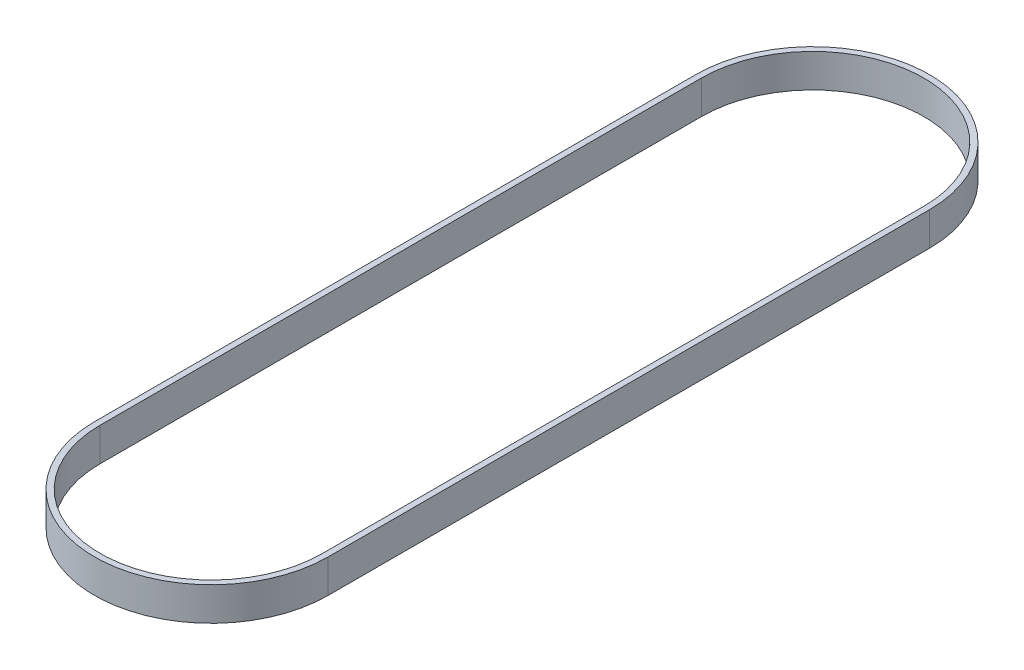
ISO-10303-21;
HEADER;
FILE_DESCRIPTION(('STEP AP214'),'2;1');
FILE_NAME('part.step','',(''),(''),'','','');
FILE_SCHEMA(('AUTOMOTIVE_DESIGN { 1 0 10303 214 1 1 1 1 }'));
ENDSEC;
DATA;
#1=APPLICATION_CONTEXT('core data for automotive mechanical design processes');
#2=APPLICATION_PROTOCOL_DEFINITION('international standard','automotive_design',2000,#1);
#3=PRODUCT_CONTEXT('',#1,'mechanical');
#4=PRODUCT('Part','Part','',(#3));
#5=PRODUCT_RELATED_PRODUCT_CATEGORY('part','',(#4));
#6=PRODUCT_DEFINITION_FORMATION('','',#4);
#7=PRODUCT_DEFINITION_CONTEXT('part definition',#1,'design');
#8=PRODUCT_DEFINITION('design','',#6,#7);
#9=PRODUCT_DEFINITION_SHAPE('','',#8);
#10=(LENGTH_UNIT() NAMED_UNIT(*) SI_UNIT(.MILLI.,.METRE.));
#11=(NAMED_UNIT(*) PLANE_ANGLE_UNIT() SI_UNIT($,.RADIAN.));
#12=(NAMED_UNIT(*) SI_UNIT($,.STERADIAN.) SOLID_ANGLE_UNIT());
#13=UNCERTAINTY_MEASURE_WITH_UNIT(LENGTH_MEASURE(1.E-05),#10,'distance_accuracy_value','');
#14=(GEOMETRIC_REPRESENTATION_CONTEXT(3) GLOBAL_UNCERTAINTY_ASSIGNED_CONTEXT((#13)) GLOBAL_UNIT_ASSIGNED_CONTEXT((#10,
#11,#12)) REPRESENTATION_CONTEXT('',''));
#15=CARTESIAN_POINT('',(0.,0.,0.));
#16=DIRECTION('',(0.,0.,1.));
#17=DIRECTION('',(1.,0.,0.));
#18=AXIS2_PLACEMENT_3D('',#15,#16,#17);
#19=CARTESIAN_POINT('',(0.,10.,-90.));
#20=DIRECTION('',(0.,1.,0.));
#21=DIRECTION('',(0.,0.,1.));
#22=AXIS2_PLACEMENT_3D('',#19,#20,#21);
#23=PLANE('',#22);
#24=CARTESIAN_POINT('',(0.,10.,-90.));
#25=DIRECTION('',(0.,1.,0.));
#26=DIRECTION('',(0.,0.,1.));
#27=AXIS2_PLACEMENT_3D('',#24,#25,#26);
#28=CIRCLE('',#27,35.);
#29=CARTESIAN_POINT('',(35.,10.,-90.));
#30=VERTEX_POINT('',#29);
#31=CARTESIAN_POINT('',(-35.,10.,-90.));
#32=VERTEX_POINT('',#31);
#33=EDGE_CURVE('E135',#30,#32,#28,.T.);
#34=ORIENTED_EDGE('',*,*,#33,.T.);
#35=DIRECTION('',(0.,0.,1.));
#36=VECTOR('',#35,1.);
#37=CARTESIAN_POINT('',(-35.,10.,-90.));
#38=LINE('',#37,#36);
#39=CARTESIAN_POINT('',(-35.,10.,90.));
#40=VERTEX_POINT('',#39);
#41=EDGE_CURVE('E138',#32,#40,#38,.T.);
#42=ORIENTED_EDGE('',*,*,#41,.T.);
#43=CARTESIAN_POINT('',(0.,10.,90.));
#44=DIRECTION('',(0.,1.,0.));
#45=DIRECTION('',(0.,0.,1.));
#46=AXIS2_PLACEMENT_3D('',#43,#44,#45);
#47=CIRCLE('',#46,35.);
#48=CARTESIAN_POINT('',(35.,10.,90.));
#49=VERTEX_POINT('',#48);
#50=EDGE_CURVE('E141',#40,#49,#47,.T.);
#51=ORIENTED_EDGE('',*,*,#50,.T.);
#52=DIRECTION('',(0.,0.,-1.));
#53=VECTOR('',#52,1.);
#54=CARTESIAN_POINT('',(35.,10.,-90.));
#55=LINE('',#54,#53);
#56=EDGE_CURVE('E143',#49,#30,#55,.T.);
#57=ORIENTED_EDGE('',*,*,#56,.T.);
#58=EDGE_LOOP('',(#34,#42,#51,#57));
#59=FACE_BOUND('',#58,.T.);
#60=DIRECTION('',(0.,0.,-1.));
#61=VECTOR('',#60,1.);
#62=CARTESIAN_POINT('',(33.26,10.,90.));
#63=LINE('',#62,#61);
#64=CARTESIAN_POINT('',(33.26,10.,90.));
#65=VERTEX_POINT('',#64);
#66=CARTESIAN_POINT('',(33.26,10.,-90.));
#67=VERTEX_POINT('',#66);
#68=EDGE_CURVE('E107',#65,#67,#63,.T.);
#69=ORIENTED_EDGE('',*,*,#68,.F.);
#70=CARTESIAN_POINT('',(0.,10.,90.));
#71=DIRECTION('',(0.,1.,0.));
#72=DIRECTION('',(0.,0.,1.));
#73=AXIS2_PLACEMENT_3D('',#70,#71,#72);
#74=CIRCLE('',#73,33.26);
#75=CARTESIAN_POINT('',(-33.26,10.,90.));
#76=VERTEX_POINT('',#75);
#77=EDGE_CURVE('E99',#76,#65,#74,.T.);
#78=ORIENTED_EDGE('',*,*,#77,.F.);
#79=DIRECTION('',(0.,0.,1.));
#80=VECTOR('',#79,1.);
#81=CARTESIAN_POINT('',(-33.26,10.,-90.));
#82=LINE('',#81,#80);
#83=CARTESIAN_POINT('',(-33.26,10.,-90.));
#84=VERTEX_POINT('',#83);
#85=EDGE_CURVE('E121',#84,#76,#82,.T.);
#86=ORIENTED_EDGE('',*,*,#85,.F.);
#87=CARTESIAN_POINT('',(0.,10.,-90.));
#88=DIRECTION('',(0.,1.,0.));
#89=DIRECTION('',(0.,0.,1.));
#90=AXIS2_PLACEMENT_3D('',#87,#88,#89);
#91=CIRCLE('',#90,33.26);
#92=EDGE_CURVE('E119',#67,#84,#91,.T.);
#93=ORIENTED_EDGE('',*,*,#92,.F.);
#94=EDGE_LOOP('',(#69,#78,#86,#93));
#95=FACE_BOUND('',#94,.T.);
#96=ADVANCED_FACE('F34',(#59,#95),#23,.T.);
#97=CARTESIAN_POINT('',(0.,0.,-90.));
#98=DIRECTION('',(0.,1.,0.));
#99=DIRECTION('',(0.,0.,1.));
#100=AXIS2_PLACEMENT_3D('',#97,#98,#99);
#101=PLANE('',#100);
#102=CARTESIAN_POINT('',(0.,0.,-90.));
#103=DIRECTION('',(0.,1.,0.));
#104=DIRECTION('',(0.,0.,1.));
#105=AXIS2_PLACEMENT_3D('',#102,#103,#104);
#106=CIRCLE('',#105,35.);
#107=CARTESIAN_POINT('',(35.,0.,-90.));
#108=VERTEX_POINT('',#107);
#109=CARTESIAN_POINT('',(-35.,0.,-90.));
#110=VERTEX_POINT('',#109);
#111=EDGE_CURVE('E115',#108,#110,#106,.T.);
#112=ORIENTED_EDGE('',*,*,#111,.F.);
#113=DIRECTION('',(0.,0.,-1.));
#114=VECTOR('',#113,1.);
#115=CARTESIAN_POINT('',(35.,0.,-90.));
#116=LINE('',#115,#114);
#117=CARTESIAN_POINT('',(35.,0.,90.));
#118=VERTEX_POINT('',#117);
#119=EDGE_CURVE('E139',#118,#108,#116,.T.);
#120=ORIENTED_EDGE('',*,*,#119,.F.);
#121=CARTESIAN_POINT('',(0.,0.,90.));
#122=DIRECTION('',(0.,1.,0.));
#123=DIRECTION('',(0.,0.,1.));
#124=AXIS2_PLACEMENT_3D('',#121,#122,#123);
#125=CIRCLE('',#124,35.);
#126=CARTESIAN_POINT('',(-35.,0.,90.));
#127=VERTEX_POINT('',#126);
#128=EDGE_CURVE('E150',#127,#118,#125,.T.);
#129=ORIENTED_EDGE('',*,*,#128,.F.);
#130=DIRECTION('',(0.,0.,1.));
#131=VECTOR('',#130,1.);
#132=CARTESIAN_POINT('',(-35.,0.,-90.));
#133=LINE('',#132,#131);
#134=EDGE_CURVE('E148',#110,#127,#133,.T.);
#135=ORIENTED_EDGE('',*,*,#134,.F.);
#136=EDGE_LOOP('',(#112,#120,#129,#135));
#137=FACE_BOUND('',#136,.T.);
#138=CARTESIAN_POINT('',(0.,0.,90.));
#139=DIRECTION('',(0.,1.,0.));
#140=DIRECTION('',(0.,0.,1.));
#141=AXIS2_PLACEMENT_3D('',#138,#139,#140);
#142=CIRCLE('',#141,33.26);
#143=CARTESIAN_POINT('',(-33.26,0.,90.));
#144=VERTEX_POINT('',#143);
#145=CARTESIAN_POINT('',(33.26,0.,90.));
#146=VERTEX_POINT('',#145);
#147=EDGE_CURVE('E57',#144,#146,#142,.T.);
#148=ORIENTED_EDGE('',*,*,#147,.T.);
#149=DIRECTION('',(0.,0.,-1.));
#150=VECTOR('',#149,1.);
#151=CARTESIAN_POINT('',(33.26,0.,90.));
#152=LINE('',#151,#150);
#153=CARTESIAN_POINT('',(33.26,0.,-90.));
#154=VERTEX_POINT('',#153);
#155=EDGE_CURVE('E114',#146,#154,#152,.T.);
#156=ORIENTED_EDGE('',*,*,#155,.T.);
#157=CARTESIAN_POINT('',(0.,0.,-90.));
#158=DIRECTION('',(0.,1.,0.));
#159=DIRECTION('',(0.,0.,1.));
#160=AXIS2_PLACEMENT_3D('',#157,#158,#159);
#161=CIRCLE('',#160,33.26);
#162=CARTESIAN_POINT('',(-33.26,0.,-90.));
#163=VERTEX_POINT('',#162);
#164=EDGE_CURVE('E127',#154,#163,#161,.T.);
#165=ORIENTED_EDGE('',*,*,#164,.T.);
#166=DIRECTION('',(0.,0.,1.));
#167=VECTOR('',#166,1.);
#168=CARTESIAN_POINT('',(-33.26,0.,-90.));
#169=LINE('',#168,#167);
#170=EDGE_CURVE('E108',#163,#144,#169,.T.);
#171=ORIENTED_EDGE('',*,*,#170,.T.);
#172=EDGE_LOOP('',(#148,#156,#165,#171));
#173=FACE_BOUND('',#172,.T.);
#174=ADVANCED_FACE('F168',(#137,#173),#101,.F.);
#175=CARTESIAN_POINT('',(0.,10.,-90.));
#176=DIRECTION('',(0.,-1.,0.));
#177=DIRECTION('',(0.,0.,-1.));
#178=AXIS2_PLACEMENT_3D('',#175,#176,#177);
#179=CYLINDRICAL_SURFACE('',#178,35.);
#180=ORIENTED_EDGE('',*,*,#111,.T.);
#181=DIRECTION('',(0.,-1.,0.));
#182=VECTOR('',#181,1.);
#183=CARTESIAN_POINT('',(-35.,10.,-90.));
#184=LINE('',#183,#182);
#185=EDGE_CURVE('E11',#32,#110,#184,.T.);
#186=ORIENTED_EDGE('',*,*,#185,.F.);
#187=ORIENTED_EDGE('',*,*,#33,.F.);
#188=DIRECTION('',(0.,-1.,0.));
#189=VECTOR('',#188,1.);
#190=CARTESIAN_POINT('',(35.,10.,-90.));
#191=LINE('',#190,#189);
#192=EDGE_CURVE('E145',#30,#108,#191,.T.);
#193=ORIENTED_EDGE('',*,*,#192,.T.);
#194=EDGE_LOOP('',(#180,#186,#187,#193));
#195=FACE_BOUND('',#194,.T.);
#196=ADVANCED_FACE('F36',(#195),#179,.T.);
#197=CARTESIAN_POINT('',(-35.,10.,-90.));
#198=DIRECTION('',(1.,0.,0.));
#199=DIRECTION('',(0.,0.,-1.));
#200=AXIS2_PLACEMENT_3D('',#197,#198,#199);
#201=PLANE('',#200);
#202=ORIENTED_EDGE('',*,*,#134,.T.);
#203=DIRECTION('',(0.,-1.,0.));
#204=VECTOR('',#203,1.);
#205=CARTESIAN_POINT('',(-35.,10.,90.));
#206=LINE('',#205,#204);
#207=EDGE_CURVE('E42',#40,#127,#206,.T.);
#208=ORIENTED_EDGE('',*,*,#207,.F.);
#209=ORIENTED_EDGE('',*,*,#41,.F.);
#210=ORIENTED_EDGE('',*,*,#185,.T.);
#211=EDGE_LOOP('',(#202,#208,#209,#210));
#212=FACE_BOUND('',#211,.T.);
#213=ADVANCED_FACE('F178',(#212),#201,.F.);
#214=CARTESIAN_POINT('',(0.,10.,90.));
#215=DIRECTION('',(0.,-1.,0.));
#216=DIRECTION('',(0.,0.,-1.));
#217=AXIS2_PLACEMENT_3D('',#214,#215,#216);
#218=CYLINDRICAL_SURFACE('',#217,35.);
#219=ORIENTED_EDGE('',*,*,#128,.T.);
#220=DIRECTION('',(0.,-1.,0.));
#221=VECTOR('',#220,1.);
#222=CARTESIAN_POINT('',(35.,10.,90.));
#223=LINE('',#222,#221);
#224=EDGE_CURVE('E155',#49,#118,#223,.T.);
#225=ORIENTED_EDGE('',*,*,#224,.F.);
#226=ORIENTED_EDGE('',*,*,#50,.F.);
#227=ORIENTED_EDGE('',*,*,#207,.T.);
#228=EDGE_LOOP('',(#219,#225,#226,#227));
#229=FACE_BOUND('',#228,.T.);
#230=ADVANCED_FACE('F162',(#229),#218,.T.);
#231=CARTESIAN_POINT('',(35.,10.,-90.));
#232=DIRECTION('',(-1.,0.,0.));
#233=DIRECTION('',(0.,0.,1.));
#234=AXIS2_PLACEMENT_3D('',#231,#232,#233);
#235=PLANE('',#234);
#236=ORIENTED_EDGE('',*,*,#119,.T.);
#237=ORIENTED_EDGE('',*,*,#192,.F.);
#238=ORIENTED_EDGE('',*,*,#56,.F.);
#239=ORIENTED_EDGE('',*,*,#224,.T.);
#240=EDGE_LOOP('',(#236,#237,#238,#239));
#241=FACE_BOUND('',#240,.T.);
#242=ADVANCED_FACE('F172',(#241),#235,.F.);
#243=CARTESIAN_POINT('',(0.,10.,90.));
#244=DIRECTION('',(0.,-1.,0.));
#245=DIRECTION('',(0.,0.,-1.));
#246=AXIS2_PLACEMENT_3D('',#243,#244,#245);
#247=CYLINDRICAL_SURFACE('',#246,33.26);
#248=ORIENTED_EDGE('',*,*,#147,.F.);
#249=DIRECTION('',(0.,-1.,0.));
#250=VECTOR('',#249,1.);
#251=CARTESIAN_POINT('',(-33.26,10.,90.));
#252=LINE('',#251,#250);
#253=EDGE_CURVE('E103',#76,#144,#252,.T.);
#254=ORIENTED_EDGE('',*,*,#253,.F.);
#255=ORIENTED_EDGE('',*,*,#77,.T.);
#256=DIRECTION('',(0.,-1.,0.));
#257=VECTOR('',#256,1.);
#258=CARTESIAN_POINT('',(33.26,10.,90.));
#259=LINE('',#258,#257);
#260=EDGE_CURVE('E102',#65,#146,#259,.T.);
#261=ORIENTED_EDGE('',*,*,#260,.T.);
#262=EDGE_LOOP('',(#248,#254,#255,#261));
#263=FACE_BOUND('',#262,.T.);
#264=ADVANCED_FACE('F101',(#263),#247,.F.);
#265=CARTESIAN_POINT('',(33.26,10.,90.));
#266=DIRECTION('',(-1.,0.,0.));
#267=DIRECTION('',(0.,0.,1.));
#268=AXIS2_PLACEMENT_3D('',#265,#266,#267);
#269=PLANE('',#268);
#270=ORIENTED_EDGE('',*,*,#155,.F.);
#271=ORIENTED_EDGE('',*,*,#260,.F.);
#272=ORIENTED_EDGE('',*,*,#68,.T.);
#273=DIRECTION('',(0.,-1.,0.));
#274=VECTOR('',#273,1.);
#275=CARTESIAN_POINT('',(33.26,10.,-90.));
#276=LINE('',#275,#274);
#277=EDGE_CURVE('E116',#67,#154,#276,.T.);
#278=ORIENTED_EDGE('',*,*,#277,.T.);
#279=EDGE_LOOP('',(#270,#271,#272,#278));
#280=FACE_BOUND('',#279,.T.);
#281=ADVANCED_FACE('F111',(#280),#269,.T.);
#282=CARTESIAN_POINT('',(0.,10.,-90.));
#283=DIRECTION('',(0.,-1.,0.));
#284=DIRECTION('',(0.,0.,-1.));
#285=AXIS2_PLACEMENT_3D('',#282,#283,#284);
#286=CYLINDRICAL_SURFACE('',#285,33.26);
#287=ORIENTED_EDGE('',*,*,#164,.F.);
#288=ORIENTED_EDGE('',*,*,#277,.F.);
#289=ORIENTED_EDGE('',*,*,#92,.T.);
#290=DIRECTION('',(0.,-1.,0.));
#291=VECTOR('',#290,1.);
#292=CARTESIAN_POINT('',(-33.26,10.,-90.));
#293=LINE('',#292,#291);
#294=EDGE_CURVE('E49',#84,#163,#293,.T.);
#295=ORIENTED_EDGE('',*,*,#294,.T.);
#296=EDGE_LOOP('',(#287,#288,#289,#295));
#297=FACE_BOUND('',#296,.T.);
#298=ADVANCED_FACE('F201',(#297),#286,.F.);
#299=CARTESIAN_POINT('',(-33.26,10.,-90.));
#300=DIRECTION('',(1.,0.,0.));
#301=DIRECTION('',(0.,0.,-1.));
#302=AXIS2_PLACEMENT_3D('',#299,#300,#301);
#303=PLANE('',#302);
#304=ORIENTED_EDGE('',*,*,#170,.F.);
#305=ORIENTED_EDGE('',*,*,#294,.F.);
#306=ORIENTED_EDGE('',*,*,#85,.T.);
#307=ORIENTED_EDGE('',*,*,#253,.T.);
#308=EDGE_LOOP('',(#304,#305,#306,#307));
#309=FACE_BOUND('',#308,.T.);
#310=ADVANCED_FACE('F205',(#309),#303,.T.);
#311=CLOSED_SHELL('',(#96,#174,#196,#213,#230,#242,#264,#281,#298,#310));
#312=MANIFOLD_SOLID_BREP('B2',#311);
#313=ADVANCED_BREP_SHAPE_REPRESENTATION('',(#18,#312),#14);
#314=SHAPE_DEFINITION_REPRESENTATION(#9,#313);
ENDSEC;
END-ISO-10303-21;
